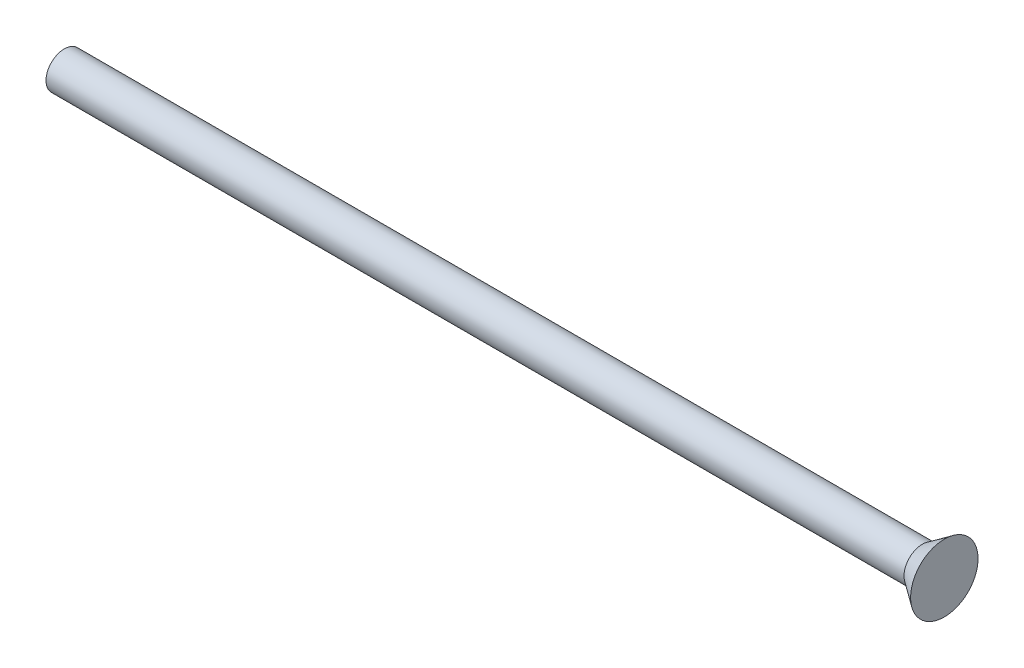
ISO-10303-21;
HEADER;
FILE_DESCRIPTION(('STEP AP214'),'2;1');
FILE_NAME('part.step','',(''),(''),'','','');
FILE_SCHEMA(('AUTOMOTIVE_DESIGN { 1 0 10303 214 1 1 1 1 }'));
ENDSEC;
DATA;
#1=APPLICATION_CONTEXT('core data for automotive mechanical design processes');
#2=APPLICATION_PROTOCOL_DEFINITION('international standard','automotive_design',2000,#1);
#3=PRODUCT_CONTEXT('',#1,'mechanical');
#4=PRODUCT('Part','Part','',(#3));
#5=PRODUCT_RELATED_PRODUCT_CATEGORY('part','',(#4));
#6=PRODUCT_DEFINITION_FORMATION('','',#4);
#7=PRODUCT_DEFINITION_CONTEXT('part definition',#1,'design');
#8=PRODUCT_DEFINITION('design','',#6,#7);
#9=PRODUCT_DEFINITION_SHAPE('','',#8);
#10=(LENGTH_UNIT() NAMED_UNIT(*) SI_UNIT(.MILLI.,.METRE.));
#11=(NAMED_UNIT(*) PLANE_ANGLE_UNIT() SI_UNIT($,.RADIAN.));
#12=(NAMED_UNIT(*) SI_UNIT($,.STERADIAN.) SOLID_ANGLE_UNIT());
#13=UNCERTAINTY_MEASURE_WITH_UNIT(LENGTH_MEASURE(1.E-05),#10,'distance_accuracy_value','');
#14=(GEOMETRIC_REPRESENTATION_CONTEXT(3) GLOBAL_UNCERTAINTY_ASSIGNED_CONTEXT((#13)) GLOBAL_UNIT_ASSIGNED_CONTEXT((#10,
#11,#12)) REPRESENTATION_CONTEXT('',''));
#15=CARTESIAN_POINT('',(0.,0.,0.));
#16=DIRECTION('',(0.,0.,1.));
#17=DIRECTION('',(1.,0.,0.));
#18=AXIS2_PLACEMENT_3D('',#15,#16,#17);
#19=CARTESIAN_POINT('',(-50.,0.,0.));
#20=DIRECTION('',(1.,0.,0.));
#21=DIRECTION('',(0.,0.,-1.));
#22=AXIS2_PLACEMENT_3D('',#19,#20,#21);
#23=PLANE('',#22);
#24=CARTESIAN_POINT('',(-50.,0.,0.));
#25=DIRECTION('',(-1.,0.,0.));
#26=DIRECTION('',(0.,0.,1.));
#27=AXIS2_PLACEMENT_3D('',#24,#25,#26);
#28=CIRCLE('',#27,1.25);
#29=CARTESIAN_POINT('',(-50.,0.,1.25));
#30=VERTEX_POINT('',#29);
#31=EDGE_CURVE('E10',#30,#30,#28,.T.);
#32=ORIENTED_EDGE('',*,*,#31,.T.);
#33=EDGE_LOOP('',(#32));
#34=FACE_BOUND('',#33,.T.);
#35=ADVANCED_FACE('F37',(#34),#23,.F.);
#36=CARTESIAN_POINT('',(-53.8440891676821,0.,0.));
#37=DIRECTION('',(-1.,0.,0.));
#38=DIRECTION('',(0.,0.,1.));
#39=AXIS2_PLACEMENT_3D('',#36,#37,#38);
#40=CYLINDRICAL_SURFACE('',#39,1.25);
#41=ORIENTED_EDGE('',*,*,#31,.F.);
#42=EDGE_LOOP('',(#41));
#43=FACE_BOUND('',#42,.T.);
#44=CARTESIAN_POINT('',(8.5,0.,0.));
#45=DIRECTION('',(-1.,0.,0.));
#46=DIRECTION('',(0.,0.,1.));
#47=AXIS2_PLACEMENT_3D('',#44,#45,#46);
#48=CIRCLE('',#47,1.25);
#49=CARTESIAN_POINT('',(8.5,0.,1.25));
#50=VERTEX_POINT('',#49);
#51=EDGE_CURVE('E43',#50,#50,#48,.T.);
#52=ORIENTED_EDGE('',*,*,#51,.T.);
#53=EDGE_LOOP('',(#52));
#54=FACE_BOUND('',#53,.T.);
#55=ADVANCED_FACE('F62',(#43,#54),#40,.T.);
#56=CARTESIAN_POINT('',(9.99999999999999,0.,0.));
#57=DIRECTION('',(1.,0.,0.));
#58=DIRECTION('',(0.,0.,-1.));
#59=AXIS2_PLACEMENT_3D('',#56,#57,#58);
#60=CONICAL_SURFACE('',#59,2.3,0.61072596438921);
#61=ORIENTED_EDGE('',*,*,#51,.F.);
#62=EDGE_LOOP('',(#61));
#63=FACE_BOUND('',#62,.T.);
#64=CARTESIAN_POINT('',(9.99999999999999,0.,0.));
#65=DIRECTION('',(-1.,0.,0.));
#66=DIRECTION('',(0.,0.,1.));
#67=AXIS2_PLACEMENT_3D('',#64,#65,#66);
#68=CIRCLE('',#67,2.3);
#69=CARTESIAN_POINT('',(9.99999999999999,0.,2.3));
#70=VERTEX_POINT('',#69);
#71=EDGE_CURVE('E47',#70,#70,#68,.T.);
#72=ORIENTED_EDGE('',*,*,#71,.T.);
#73=EDGE_LOOP('',(#72));
#74=FACE_BOUND('',#73,.T.);
#75=ADVANCED_FACE('F54',(#63,#74),#60,.T.);
#76=CARTESIAN_POINT('',(10.,2.3,0.));
#77=DIRECTION('',(-1.,0.,0.));
#78=DIRECTION('',(0.,0.,1.));
#79=AXIS2_PLACEMENT_3D('',#76,#77,#78);
#80=PLANE('',#79);
#81=ORIENTED_EDGE('',*,*,#71,.F.);
#82=EDGE_LOOP('',(#81));
#83=FACE_BOUND('',#82,.T.);
#84=ADVANCED_FACE('F56',(#83),#80,.F.);
#85=CLOSED_SHELL('',(#35,#55,#75,#84));
#86=MANIFOLD_SOLID_BREP('B2',#85);
#87=ADVANCED_BREP_SHAPE_REPRESENTATION('',(#18,#86),#14);
#88=SHAPE_DEFINITION_REPRESENTATION(#9,#87);
ENDSEC;
END-ISO-10303-21;
